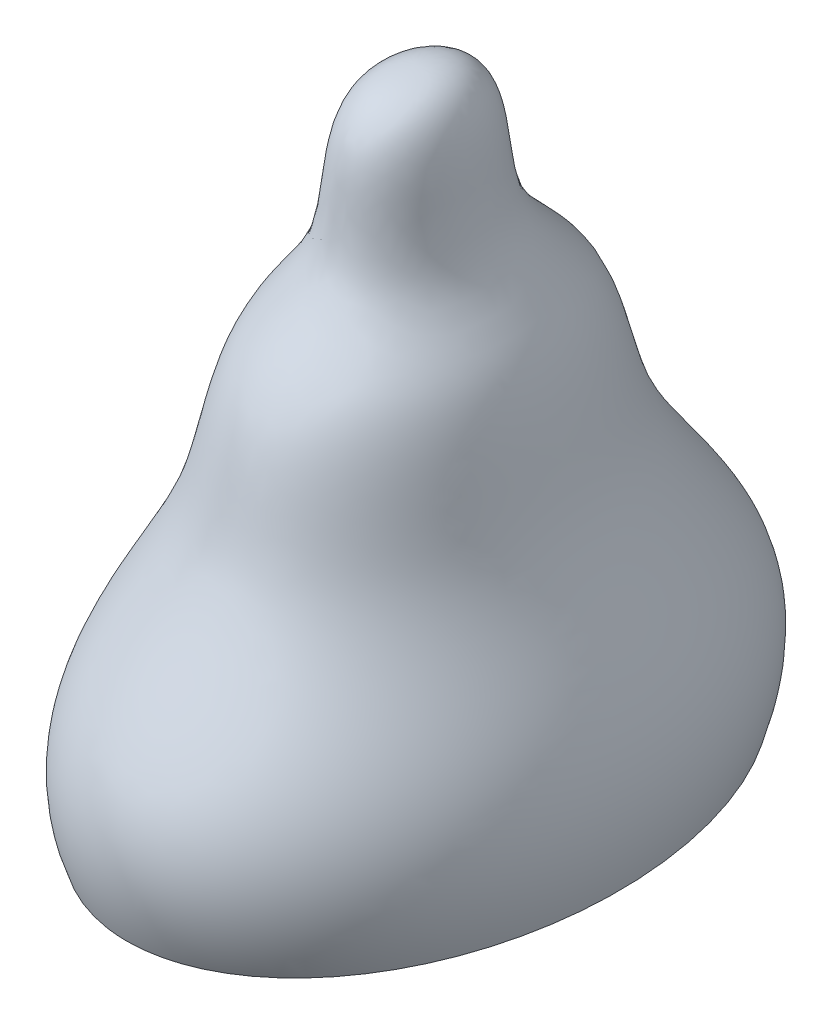
ISO-10303-21;
HEADER;
FILE_DESCRIPTION(('STEP AP214'),'2;1');
FILE_NAME('part.step','',(''),(''),'','','');
FILE_SCHEMA(('AUTOMOTIVE_DESIGN { 1 0 10303 214 1 1 1 1 }'));
ENDSEC;
DATA;
#1=APPLICATION_CONTEXT('core data for automotive mechanical design processes');
#2=APPLICATION_PROTOCOL_DEFINITION('international standard','automotive_design',2000,#1);
#3=PRODUCT_CONTEXT('',#1,'mechanical');
#4=PRODUCT('Part','Part','',(#3));
#5=PRODUCT_RELATED_PRODUCT_CATEGORY('part','',(#4));
#6=PRODUCT_DEFINITION_FORMATION('','',#4);
#7=PRODUCT_DEFINITION_CONTEXT('part definition',#1,'design');
#8=PRODUCT_DEFINITION('design','',#6,#7);
#9=PRODUCT_DEFINITION_SHAPE('','',#8);
#10=(LENGTH_UNIT() NAMED_UNIT(*) SI_UNIT(.MILLI.,.METRE.));
#11=(NAMED_UNIT(*) PLANE_ANGLE_UNIT() SI_UNIT($,.RADIAN.));
#12=(NAMED_UNIT(*) SI_UNIT($,.STERADIAN.) SOLID_ANGLE_UNIT());
#13=UNCERTAINTY_MEASURE_WITH_UNIT(LENGTH_MEASURE(1.E-05),#10,'distance_accuracy_value','');
#14=(GEOMETRIC_REPRESENTATION_CONTEXT(3) GLOBAL_UNCERTAINTY_ASSIGNED_CONTEXT((#13)) GLOBAL_UNIT_ASSIGNED_CONTEXT((#10,
#11,#12)) REPRESENTATION_CONTEXT('',''));
#15=CARTESIAN_POINT('',(0.,0.,0.));
#16=DIRECTION('',(0.,0.,1.));
#17=DIRECTION('',(1.,0.,0.));
#18=AXIS2_PLACEMENT_3D('',#15,#16,#17);
#19=CARTESIAN_POINT('',(0.,0.,-100.));
#20=CARTESIAN_POINT('',(-140.,0.,-100.));
#21=CARTESIAN_POINT('',(-140.,0.,100.));
#22=CARTESIAN_POINT('',(0.,0.,100.));
#23=CARTESIAN_POINT('',(140.,0.,100.));
#24=CARTESIAN_POINT('',(140.,0.,-100.));
#25=CARTESIAN_POINT('',(0.,0.,-100.));
#26=CARTESIAN_POINT('',(0.,44.0665978530808,-117.70222452832));
#27=CARTESIAN_POINT('',(-164.783114339648,44.0665978530808,-117.70222452832));
#28=CARTESIAN_POINT('',(-164.783114339648,44.0665978530808,117.70222452832));
#29=CARTESIAN_POINT('',(0.,44.0665978530808,117.70222452832));
#30=CARTESIAN_POINT('',(164.783114339648,44.0665978530808,117.70222452832));
#31=CARTESIAN_POINT('',(164.783114339648,44.0665978530808,-117.70222452832));
#32=CARTESIAN_POINT('',(0.,44.0665978530808,-117.70222452832));
#33=CARTESIAN_POINT('',(0.,73.6093197149483,-64.622437880105));
#34=CARTESIAN_POINT('',(-90.471413032147,73.6093197149483,-64.622437880105));
#35=CARTESIAN_POINT('',(-90.471413032147,73.6093197149483,64.622437880105));
#36=CARTESIAN_POINT('',(0.,73.6093197149483,64.622437880105));
#37=CARTESIAN_POINT('',(90.471413032147,73.6093197149483,64.622437880105));
#38=CARTESIAN_POINT('',(90.471413032147,73.6093197149483,-64.622437880105));
#39=CARTESIAN_POINT('',(0.,73.6093197149483,-64.622437880105));
#40=CARTESIAN_POINT('',(0.,139.038652660092,-59.3006951332746));
#41=CARTESIAN_POINT('',(-83.0209731865844,139.038652660092,-59.3006951332746));
#42=CARTESIAN_POINT('',(-83.0209731865844,139.038652660092,59.3006951332746));
#43=CARTESIAN_POINT('',(0.,139.038652660092,59.3006951332746));
#44=CARTESIAN_POINT('',(83.0209731865844,139.038652660092,59.3006951332746));
#45=CARTESIAN_POINT('',(83.0209731865844,139.038652660092,-59.3006951332746));
#46=CARTESIAN_POINT('',(0.,139.038652660092,-59.3006951332746));
#47=CARTESIAN_POINT('',(0.,168.318291320934,-17.2172166857043));
#48=CARTESIAN_POINT('',(-24.1041033599861,168.318291320934,-17.2172166857043));
#49=CARTESIAN_POINT('',(-24.1041033599861,168.318291320934,17.2172166857043));
#50=CARTESIAN_POINT('',(0.,168.318291320934,17.2172166857043));
#51=CARTESIAN_POINT('',(24.1041033599861,168.318291320934,17.2172166857043));
#52=CARTESIAN_POINT('',(24.1041033599861,168.318291320934,-17.2172166857043));
#53=CARTESIAN_POINT('',(0.,168.318291320934,-17.2172166857043));
#54=CARTESIAN_POINT('',(0.,211.978696073063,-32.7845554322957));
#55=CARTESIAN_POINT('',(-45.898377605214,211.978696073063,-32.7845554322957));
#56=CARTESIAN_POINT('',(-45.898377605214,211.978696073063,32.7845554322957));
#57=CARTESIAN_POINT('',(0.,211.978696073063,32.7845554322957));
#58=CARTESIAN_POINT('',(45.898377605214,211.978696073063,32.7845554322957));
#59=CARTESIAN_POINT('',(45.898377605214,211.978696073063,-32.7845554322957));
#60=CARTESIAN_POINT('',(0.,211.978696073063,-32.7845554322957));
#61=CARTESIAN_POINT('',(0.,212.407673465066,0.));
#62=CARTESIAN_POINT('',(1.06227444256742E-13,212.407673465066,0.));
#63=CARTESIAN_POINT('',(1.06227444256742E-13,212.407673465066,0.));
#64=CARTESIAN_POINT('',(0.,212.407673465066,0.));
#65=CARTESIAN_POINT('',(-1.06227444256742E-13,212.407673465066,0.));
#66=CARTESIAN_POINT('',(-1.06227444256742E-13,212.407673465066,0.));
#67=CARTESIAN_POINT('',(0.,212.407673465066,0.));
#68=(BOUNDED_SURFACE() B_SPLINE_SURFACE(3,3,((#19,#20,#21,#22,#23,#24,#25),(#26,#27,#28,#29,#30,
#31,#32),(#33,#34,#35,#36,#37,#38,#39),(#40,#41,#42,#43,#44,#45,#46),(#47,#48,#49,#50,#51,#52,
#53),(#54,#55,#56,#57,#58,#59,#60),(#61,#62,#63,#64,#65,#66,#67)),.UNSPECIFIED.,.F.,.T.,
.F.) B_SPLINE_SURFACE_WITH_KNOTS((4,1,1,1,4),(4,3,4),(0.,0.42425642640766,0.619048051996362,
0.743887986214231,1.),(0.,0.5,1.),
.UNSPECIFIED.) GEOMETRIC_REPRESENTATION_ITEM() RATIONAL_B_SPLINE_SURFACE(((1.,0.333333333333333,
0.333333333333333,1.,0.333333333333333,0.333333333333333,1.),(1.,0.333333333333333,
0.333333333333333,1.,0.333333333333333,0.333333333333333,1.),(1.,0.333333333333333,
0.333333333333333,1.,0.333333333333333,0.333333333333333,1.),(1.,0.333333333333333,
0.333333333333333,1.,0.333333333333333,0.333333333333333,1.),(1.,0.333333333333333,
0.333333333333333,1.,0.333333333333333,0.333333333333333,1.),(1.,0.333333333333333,
0.333333333333333,1.,0.333333333333333,0.333333333333333,1.),(1.,0.333333333333333,
0.333333333333333,1.,0.333333333333333,0.333333333333333,1.))) REPRESENTATION_ITEM('') SURFACE());
#69=CARTESIAN_POINT('',(0.,0.,100.));
#70=CARTESIAN_POINT('',(140.,0.,100.));
#71=CARTESIAN_POINT('',(140.,0.,-100.));
#72=CARTESIAN_POINT('',(0.,0.,-100.));
#73=CARTESIAN_POINT('',(-140.,0.,-100.));
#74=CARTESIAN_POINT('',(-140.,0.,100.));
#75=CARTESIAN_POINT('',(0.,0.,100.));
#76=(BOUNDED_CURVE() B_SPLINE_CURVE(3,(#69,#70,#71,#72,#73,#74,#75),.UNSPECIFIED.,.T.,
.F.) B_SPLINE_CURVE_WITH_KNOTS((4,3,4),(0.,0.5,1.),
.UNSPECIFIED.) CURVE() GEOMETRIC_REPRESENTATION_ITEM() RATIONAL_B_SPLINE_CURVE((1.,
0.333333333333333,0.333333333333333,1.,0.333333333333333,0.333333333333333,1.)) REPRESENTATION_ITEM(''));
#77=CARTESIAN_POINT('',(0.,0.,100.));
#78=VERTEX_POINT('',#77);
#79=EDGE_CURVE('E11',#78,#78,#76,.T.);
#80=CARTESIAN_POINT('',(0.,212.407673465066,0.));
#81=VERTEX_POINT('',#80);
#82=VERTEX_LOOP('',#81);
#83=FACE_BOUND('',#82,.T.);
#84=ORIENTED_EDGE('',*,*,#79,.T.);
#85=EDGE_LOOP('',(#84));
#86=FACE_BOUND('',#85,.T.);
#87=ADVANCED_FACE('F35',(#83,#86),#68,.F.);
#88=CARTESIAN_POINT('',(0.,0.,-100.));
#89=DIRECTION('',(0.,1.,0.));
#90=DIRECTION('',(0.,0.,1.));
#91=AXIS2_PLACEMENT_3D('',#88,#89,#90);
#92=PLANE('',#91);
#93=ORIENTED_EDGE('',*,*,#79,.F.);
#94=EDGE_LOOP('',(#93));
#95=FACE_BOUND('',#94,.T.);
#96=ADVANCED_FACE('F37',(#95),#92,.F.);
#97=CLOSED_SHELL('',(#87,#96));
#98=MANIFOLD_SOLID_BREP('B2',#97);
#99=ADVANCED_BREP_SHAPE_REPRESENTATION('',(#18,#98),#14);
#100=SHAPE_DEFINITION_REPRESENTATION(#9,#99);
ENDSEC;
END-ISO-10303-21;
